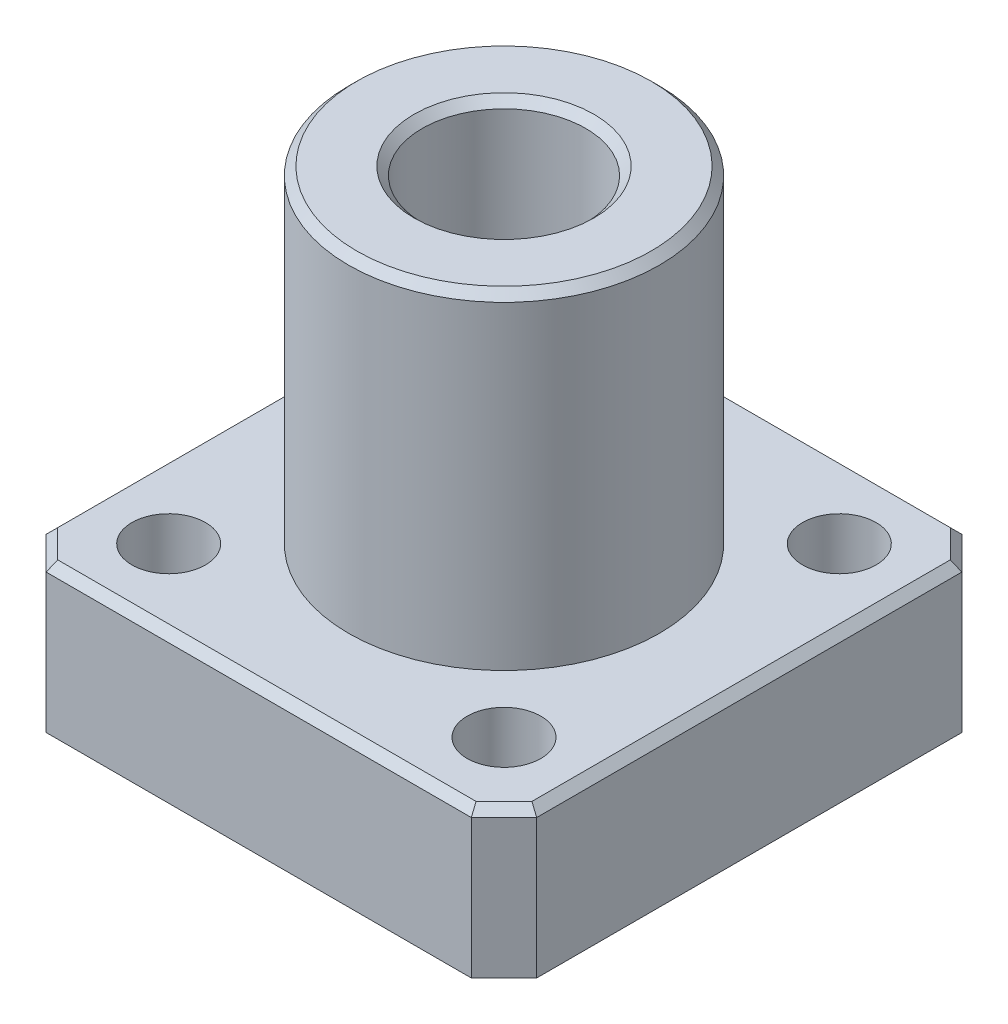
ISO-10303-21;
HEADER;
FILE_DESCRIPTION(('STEP AP214'),'2;1');
FILE_NAME('part.step','',(''),(''),'','','');
FILE_SCHEMA(('AUTOMOTIVE_DESIGN { 1 0 10303 214 1 1 1 1 }'));
ENDSEC;
DATA;
#1=APPLICATION_CONTEXT('core data for automotive mechanical design processes');
#2=APPLICATION_PROTOCOL_DEFINITION('international standard','automotive_design',2000,#1);
#3=PRODUCT_CONTEXT('',#1,'mechanical');
#4=PRODUCT('Part','Part','',(#3));
#5=PRODUCT_RELATED_PRODUCT_CATEGORY('part','',(#4));
#6=PRODUCT_DEFINITION_FORMATION('','',#4);
#7=PRODUCT_DEFINITION_CONTEXT('part definition',#1,'design');
#8=PRODUCT_DEFINITION('design','',#6,#7);
#9=PRODUCT_DEFINITION_SHAPE('','',#8);
#10=(LENGTH_UNIT() NAMED_UNIT(*) SI_UNIT(.MILLI.,.METRE.));
#11=(NAMED_UNIT(*) PLANE_ANGLE_UNIT() SI_UNIT($,.RADIAN.));
#12=(NAMED_UNIT(*) SI_UNIT($,.STERADIAN.) SOLID_ANGLE_UNIT());
#13=UNCERTAINTY_MEASURE_WITH_UNIT(LENGTH_MEASURE(1.E-05),#10,'distance_accuracy_value','');
#14=(GEOMETRIC_REPRESENTATION_CONTEXT(3) GLOBAL_UNCERTAINTY_ASSIGNED_CONTEXT((#13)) GLOBAL_UNIT_ASSIGNED_CONTEXT((#10,
#11,#12)) REPRESENTATION_CONTEXT('',''));
#15=CARTESIAN_POINT('',(0.,0.,0.));
#16=DIRECTION('',(0.,0.,1.));
#17=DIRECTION('',(1.,0.,0.));
#18=AXIS2_PLACEMENT_3D('',#15,#16,#17);
#19=CARTESIAN_POINT('',(0.,9.,-30.));
#20=DIRECTION('',(0.,-1.,0.));
#21=DIRECTION('',(0.,0.,-1.));
#22=AXIS2_PLACEMENT_3D('',#19,#20,#21);
#23=PLANE('',#22);
#24=DIRECTION('',(0.,0.,-1.));
#25=VECTOR('',#24,1.);
#26=CARTESIAN_POINT('',(29.5,9.,-30.));
#27=LINE('',#26,#25);
#28=CARTESIAN_POINT('',(29.5,9.,-2.20710678118656));
#29=VERTEX_POINT('',#28);
#30=CARTESIAN_POINT('',(29.5,9.,-27.7928932188134));
#31=VERTEX_POINT('',#30);
#32=EDGE_CURVE('E207',#29,#31,#27,.T.);
#33=ORIENTED_EDGE('',*,*,#32,.T.);
#34=DIRECTION('',(-0.707106781186546,0.,-0.707106781186549));
#35=VECTOR('',#34,1.);
#36=CARTESIAN_POINT('',(27.6464466094067,9.,-29.6464466094067));
#37=LINE('',#36,#35);
#38=CARTESIAN_POINT('',(27.7928932188134,9.,-29.5));
#39=VERTEX_POINT('',#38);
#40=EDGE_CURVE('E209',#31,#39,#37,.T.);
#41=ORIENTED_EDGE('',*,*,#40,.T.);
#42=DIRECTION('',(-1.,0.,0.));
#43=VECTOR('',#42,1.);
#44=CARTESIAN_POINT('',(0.,9.,-29.5));
#45=LINE('',#44,#43);
#46=CARTESIAN_POINT('',(2.20710678118656,9.,-29.5));
#47=VERTEX_POINT('',#46);
#48=EDGE_CURVE('E199',#39,#47,#45,.T.);
#49=ORIENTED_EDGE('',*,*,#48,.T.);
#50=DIRECTION('',(-0.707106781186549,0.,0.707106781186546));
#51=VECTOR('',#50,1.);
#52=CARTESIAN_POINT('',(0.35355339059327,9.,-27.6464466094067));
#53=LINE('',#52,#51);
#54=CARTESIAN_POINT('',(0.5,9.,-27.7928932188134));
#55=VERTEX_POINT('',#54);
#56=EDGE_CURVE('E197',#47,#55,#53,.T.);
#57=ORIENTED_EDGE('',*,*,#56,.T.);
#58=DIRECTION('',(0.,0.,1.));
#59=VECTOR('',#58,1.);
#60=CARTESIAN_POINT('',(0.5,9.,-30.));
#61=LINE('',#60,#59);
#62=CARTESIAN_POINT('',(0.5,9.,-2.20710678118656));
#63=VERTEX_POINT('',#62);
#64=EDGE_CURVE('E195',#55,#63,#61,.T.);
#65=ORIENTED_EDGE('',*,*,#64,.T.);
#66=DIRECTION('',(0.707106781186546,0.,0.707106781186549));
#67=VECTOR('',#66,1.);
#68=CARTESIAN_POINT('',(2.35355339059328,9.,-0.353553390593274));
#69=LINE('',#68,#67);
#70=CARTESIAN_POINT('',(2.20710678118656,9.,-0.5));
#71=VERTEX_POINT('',#70);
#72=EDGE_CURVE('E201',#63,#71,#69,.T.);
#73=ORIENTED_EDGE('',*,*,#72,.T.);
#74=DIRECTION('',(1.,0.,0.));
#75=VECTOR('',#74,1.);
#76=CARTESIAN_POINT('',(0.,9.,-0.5));
#77=LINE('',#76,#75);
#78=CARTESIAN_POINT('',(27.7928932188134,9.,-0.5));
#79=VERTEX_POINT('',#78);
#80=EDGE_CURVE('E203',#71,#79,#77,.T.);
#81=ORIENTED_EDGE('',*,*,#80,.T.);
#82=DIRECTION('',(0.707106781186549,0.,-0.707106781186546));
#83=VECTOR('',#82,1.);
#84=CARTESIAN_POINT('',(29.6464466094067,9.,-2.35355339059328));
#85=LINE('',#84,#83);
#86=EDGE_CURVE('E205',#79,#29,#85,.T.);
#87=ORIENTED_EDGE('',*,*,#86,.T.);
#88=EDGE_LOOP('',(#33,#41,#49,#57,#65,#73,#81,#87));
#89=FACE_BOUND('',#88,.T.);
#90=CARTESIAN_POINT('',(4.74695167279506,9.,-4.74695167279506));
#91=DIRECTION('',(0.,1.,0.));
#92=DIRECTION('',(0.,0.,-1.));
#93=AXIS2_PLACEMENT_3D('',#90,#91,#92);
#94=CIRCLE('',#93,2.25);
#95=CARTESIAN_POINT('',(4.74695167279506,9.,-6.99695167279506));
#96=VERTEX_POINT('',#95);
#97=EDGE_CURVE('E253',#96,#96,#94,.T.);
#98=ORIENTED_EDGE('',*,*,#97,.F.);
#99=EDGE_LOOP('',(#98));
#100=FACE_BOUND('',#99,.T.);
#101=CARTESIAN_POINT('',(25.2530483272049,9.,-25.2530483272049));
#102=DIRECTION('',(0.,1.,0.));
#103=DIRECTION('',(0.,0.,-1.));
#104=AXIS2_PLACEMENT_3D('',#101,#102,#103);
#105=CIRCLE('',#104,2.25);
#106=CARTESIAN_POINT('',(25.2530483272049,9.,-27.5030483272049));
#107=VERTEX_POINT('',#106);
#108=EDGE_CURVE('E267',#107,#107,#105,.T.);
#109=ORIENTED_EDGE('',*,*,#108,.F.);
#110=EDGE_LOOP('',(#109));
#111=FACE_BOUND('',#110,.T.);
#112=CARTESIAN_POINT('',(4.74695167279506,9.,-25.2530483272049));
#113=DIRECTION('',(0.,1.,0.));
#114=DIRECTION('',(0.,0.,1.));
#115=AXIS2_PLACEMENT_3D('',#112,#113,#114);
#116=CIRCLE('',#115,2.25);
#117=CARTESIAN_POINT('',(4.74695167279506,9.,-23.0030483272049));
#118=VERTEX_POINT('',#117);
#119=EDGE_CURVE('E143',#118,#118,#116,.T.);
#120=ORIENTED_EDGE('',*,*,#119,.F.);
#121=EDGE_LOOP('',(#120));
#122=FACE_BOUND('',#121,.T.);
#123=CARTESIAN_POINT('',(25.2530483272049,9.,-4.74695167279506));
#124=DIRECTION('',(0.,1.,0.));
#125=DIRECTION('',(0.,0.,1.));
#126=AXIS2_PLACEMENT_3D('',#123,#124,#125);
#127=CIRCLE('',#126,2.25);
#128=CARTESIAN_POINT('',(25.2530483272049,9.,-2.49695167279506));
#129=VERTEX_POINT('',#128);
#130=EDGE_CURVE('E261',#129,#129,#127,.T.);
#131=ORIENTED_EDGE('',*,*,#130,.F.);
#132=EDGE_LOOP('',(#131));
#133=FACE_BOUND('',#132,.T.);
#134=CARTESIAN_POINT('',(15.,9.,-15.));
#135=DIRECTION('',(0.,-1.,0.));
#136=DIRECTION('',(0.,0.,-1.));
#137=AXIS2_PLACEMENT_3D('',#134,#135,#136);
#138=CIRCLE('',#137,9.5);
#139=CARTESIAN_POINT('',(15.,9.,-24.5));
#140=VERTEX_POINT('',#139);
#141=EDGE_CURVE('E157',#140,#140,#138,.F.);
#142=ORIENTED_EDGE('',*,*,#141,.F.);
#143=EDGE_LOOP('',(#142));
#144=FACE_BOUND('',#143,.T.);
#145=ADVANCED_FACE('F31',(#89,#100,#111,#122,#133,#144),#23,.F.);
#146=CARTESIAN_POINT('',(0.,0.,-30.));
#147=DIRECTION('',(0.,-1.,0.));
#148=DIRECTION('',(0.,0.,-1.));
#149=AXIS2_PLACEMENT_3D('',#146,#147,#148);
#150=PLANE('',#149);
#151=CARTESIAN_POINT('',(15.,0.,-15.));
#152=DIRECTION('',(0.,-1.,0.));
#153=DIRECTION('',(0.,0.,-1.));
#154=AXIS2_PLACEMENT_3D('',#151,#152,#153);
#155=CIRCLE('',#154,5.49999999999999);
#156=CARTESIAN_POINT('',(15.,0.,-20.5));
#157=VERTEX_POINT('',#156);
#158=EDGE_CURVE('E192',#157,#157,#155,.F.);
#159=ORIENTED_EDGE('',*,*,#158,.T.);
#160=EDGE_LOOP('',(#159));
#161=FACE_BOUND('',#160,.T.);
#162=CARTESIAN_POINT('',(25.2530483272049,0.,-4.74695167279506));
#163=DIRECTION('',(0.,1.,0.));
#164=DIRECTION('',(0.,0.,1.));
#165=AXIS2_PLACEMENT_3D('',#162,#163,#164);
#166=CIRCLE('',#165,2.25);
#167=CARTESIAN_POINT('',(25.2530483272049,0.,-2.49695167279506));
#168=VERTEX_POINT('',#167);
#169=EDGE_CURVE('E258',#168,#168,#166,.T.);
#170=ORIENTED_EDGE('',*,*,#169,.T.);
#171=EDGE_LOOP('',(#170));
#172=FACE_BOUND('',#171,.T.);
#173=CARTESIAN_POINT('',(4.74695167279506,0.,-25.2530483272049));
#174=DIRECTION('',(0.,1.,0.));
#175=DIRECTION('',(0.,0.,1.));
#176=AXIS2_PLACEMENT_3D('',#173,#174,#175);
#177=CIRCLE('',#176,2.25);
#178=CARTESIAN_POINT('',(4.74695167279506,0.,-23.0030483272049));
#179=VERTEX_POINT('',#178);
#180=EDGE_CURVE('E149',#179,#179,#177,.T.);
#181=ORIENTED_EDGE('',*,*,#180,.T.);
#182=EDGE_LOOP('',(#181));
#183=FACE_BOUND('',#182,.T.);
#184=DIRECTION('',(0.,0.,1.));
#185=VECTOR('',#184,1.);
#186=CARTESIAN_POINT('',(0.,0.,0.));
#187=LINE('',#186,#185);
#188=CARTESIAN_POINT('',(0.,0.,-28.));
#189=VERTEX_POINT('',#188);
#190=CARTESIAN_POINT('',(0.,0.,-2.00000000000002));
#191=VERTEX_POINT('',#190);
#192=EDGE_CURVE('E123',#189,#191,#187,.T.);
#193=ORIENTED_EDGE('',*,*,#192,.F.);
#194=DIRECTION('',(-0.707106781186549,0.,0.707106781186546));
#195=VECTOR('',#194,1.);
#196=CARTESIAN_POINT('',(1.,0.,-29.));
#197=LINE('',#196,#195);
#198=CARTESIAN_POINT('',(2.00000000000002,0.,-30.));
#199=VERTEX_POINT('',#198);
#200=EDGE_CURVE('E129',#189,#199,#197,.F.);
#201=ORIENTED_EDGE('',*,*,#200,.T.);
#202=DIRECTION('',(-1.,0.,0.));
#203=VECTOR('',#202,1.);
#204=CARTESIAN_POINT('',(0.,0.,-30.));
#205=LINE('',#204,#203);
#206=CARTESIAN_POINT('',(28.,0.,-30.));
#207=VERTEX_POINT('',#206);
#208=EDGE_CURVE('E155',#207,#199,#205,.T.);
#209=ORIENTED_EDGE('',*,*,#208,.F.);
#210=DIRECTION('',(-0.707106781186546,0.,-0.707106781186549));
#211=VECTOR('',#210,1.);
#212=CARTESIAN_POINT('',(14.,0.,-44.));
#213=LINE('',#212,#211);
#214=CARTESIAN_POINT('',(30.,0.,-28.));
#215=VERTEX_POINT('',#214);
#216=EDGE_CURVE('E136',#207,#215,#213,.F.);
#217=ORIENTED_EDGE('',*,*,#216,.T.);
#218=DIRECTION('',(0.,0.,-1.));
#219=VECTOR('',#218,1.);
#220=CARTESIAN_POINT('',(30.,0.,0.));
#221=LINE('',#220,#219);
#222=CARTESIAN_POINT('',(30.,0.,-2.00000000000003));
#223=VERTEX_POINT('',#222);
#224=EDGE_CURVE('E146',#223,#215,#221,.T.);
#225=ORIENTED_EDGE('',*,*,#224,.F.);
#226=DIRECTION('',(0.707106781186549,0.,-0.707106781186546));
#227=VECTOR('',#226,1.);
#228=CARTESIAN_POINT('',(28.9999999999999,0.,-0.999999999999966));
#229=LINE('',#228,#227);
#230=CARTESIAN_POINT('',(28.,0.,0.));
#231=VERTEX_POINT('',#230);
#232=EDGE_CURVE('E162',#223,#231,#229,.F.);
#233=ORIENTED_EDGE('',*,*,#232,.T.);
#234=DIRECTION('',(1.,0.,0.));
#235=VECTOR('',#234,1.);
#236=CARTESIAN_POINT('',(0.,0.,0.));
#237=LINE('',#236,#235);
#238=CARTESIAN_POINT('',(2.00000000000002,0.,0.));
#239=VERTEX_POINT('',#238);
#240=EDGE_CURVE('E142',#239,#231,#237,.T.);
#241=ORIENTED_EDGE('',*,*,#240,.F.);
#242=DIRECTION('',(0.707106781186546,0.,0.707106781186549));
#243=VECTOR('',#242,1.);
#244=CARTESIAN_POINT('',(-14.,0.,-16.0000000000001));
#245=LINE('',#244,#243);
#246=EDGE_CURVE('E126',#239,#191,#245,.F.);
#247=ORIENTED_EDGE('',*,*,#246,.T.);
#248=EDGE_LOOP('',(#193,#201,#209,#217,#225,#233,#241,#247));
#249=FACE_BOUND('',#248,.T.);
#250=CARTESIAN_POINT('',(25.2530483272049,0.,-25.2530483272049));
#251=DIRECTION('',(0.,1.,0.));
#252=DIRECTION('',(0.,0.,-1.));
#253=AXIS2_PLACEMENT_3D('',#250,#251,#252);
#254=CIRCLE('',#253,2.25);
#255=CARTESIAN_POINT('',(25.2530483272049,0.,-27.5030483272049));
#256=VERTEX_POINT('',#255);
#257=EDGE_CURVE('E264',#256,#256,#254,.T.);
#258=ORIENTED_EDGE('',*,*,#257,.T.);
#259=EDGE_LOOP('',(#258));
#260=FACE_BOUND('',#259,.T.);
#261=CARTESIAN_POINT('',(4.74695167279506,0.,-4.74695167279506));
#262=DIRECTION('',(0.,1.,0.));
#263=DIRECTION('',(0.,0.,-1.));
#264=AXIS2_PLACEMENT_3D('',#261,#262,#263);
#265=CIRCLE('',#264,2.25);
#266=CARTESIAN_POINT('',(4.74695167279506,0.,-6.99695167279506));
#267=VERTEX_POINT('',#266);
#268=EDGE_CURVE('E247',#267,#267,#265,.T.);
#269=ORIENTED_EDGE('',*,*,#268,.T.);
#270=EDGE_LOOP('',(#269));
#271=FACE_BOUND('',#270,.T.);
#272=ADVANCED_FACE('F138',(#161,#172,#183,#249,#260,#271),#150,.T.);
#273=CARTESIAN_POINT('',(0.,9.,0.));
#274=DIRECTION('',(1.,0.,0.));
#275=DIRECTION('',(0.,0.,-1.));
#276=AXIS2_PLACEMENT_3D('',#273,#274,#275);
#277=PLANE('',#276);
#278=DIRECTION('',(0.,1.,0.));
#279=VECTOR('',#278,1.);
#280=CARTESIAN_POINT('',(0.,9.,-2.00000000000002));
#281=LINE('',#280,#279);
#282=CARTESIAN_POINT('',(0.,8.5,-2.00000000000002));
#283=VERTEX_POINT('',#282);
#284=EDGE_CURVE('E127',#191,#283,#281,.T.);
#285=ORIENTED_EDGE('',*,*,#284,.T.);
#286=DIRECTION('',(0.,0.,-1.));
#287=VECTOR('',#286,1.);
#288=CARTESIAN_POINT('',(0.,8.5,0.));
#289=LINE('',#288,#287);
#290=CARTESIAN_POINT('',(0.,8.5,-28.));
#291=VERTEX_POINT('',#290);
#292=EDGE_CURVE('E11',#283,#291,#289,.T.);
#293=ORIENTED_EDGE('',*,*,#292,.T.);
#294=DIRECTION('',(0.,-1.,0.));
#295=VECTOR('',#294,1.);
#296=CARTESIAN_POINT('',(0.,9.,-28.));
#297=LINE('',#296,#295);
#298=EDGE_CURVE('E119',#291,#189,#297,.T.);
#299=ORIENTED_EDGE('',*,*,#298,.T.);
#300=ORIENTED_EDGE('',*,*,#192,.T.);
#301=EDGE_LOOP('',(#285,#293,#299,#300));
#302=FACE_BOUND('',#301,.T.);
#303=ADVANCED_FACE('F121',(#302),#277,.F.);
#304=CARTESIAN_POINT('',(0.,9.,0.));
#305=DIRECTION('',(0.,0.,-1.));
#306=DIRECTION('',(-1.,0.,0.));
#307=AXIS2_PLACEMENT_3D('',#304,#305,#306);
#308=PLANE('',#307);
#309=DIRECTION('',(0.,1.,0.));
#310=VECTOR('',#309,1.);
#311=CARTESIAN_POINT('',(28.,9.,0.));
#312=LINE('',#311,#310);
#313=CARTESIAN_POINT('',(28.,8.5,0.));
#314=VERTEX_POINT('',#313);
#315=EDGE_CURVE('E174',#231,#314,#312,.T.);
#316=ORIENTED_EDGE('',*,*,#315,.T.);
#317=DIRECTION('',(-1.,0.,0.));
#318=VECTOR('',#317,1.);
#319=CARTESIAN_POINT('',(0.,8.5,0.));
#320=LINE('',#319,#318);
#321=CARTESIAN_POINT('',(2.00000000000001,8.5,0.));
#322=VERTEX_POINT('',#321);
#323=EDGE_CURVE('E219',#314,#322,#320,.T.);
#324=ORIENTED_EDGE('',*,*,#323,.T.);
#325=DIRECTION('',(0.,-1.,0.));
#326=VECTOR('',#325,1.);
#327=CARTESIAN_POINT('',(2.00000000000001,9.,0.));
#328=LINE('',#327,#326);
#329=EDGE_CURVE('E172',#322,#239,#328,.T.);
#330=ORIENTED_EDGE('',*,*,#329,.T.);
#331=ORIENTED_EDGE('',*,*,#240,.T.);
#332=EDGE_LOOP('',(#316,#324,#330,#331));
#333=FACE_BOUND('',#332,.T.);
#334=ADVANCED_FACE('F305',(#333),#308,.F.);
#335=CARTESIAN_POINT('',(30.,9.,0.));
#336=DIRECTION('',(-1.,0.,0.));
#337=DIRECTION('',(0.,0.,1.));
#338=AXIS2_PLACEMENT_3D('',#335,#336,#337);
#339=PLANE('',#338);
#340=DIRECTION('',(0.,1.,0.));
#341=VECTOR('',#340,1.);
#342=CARTESIAN_POINT('',(30.,9.,-28.));
#343=LINE('',#342,#341);
#344=CARTESIAN_POINT('',(30.,8.5,-28.));
#345=VERTEX_POINT('',#344);
#346=EDGE_CURVE('E169',#215,#345,#343,.T.);
#347=ORIENTED_EDGE('',*,*,#346,.T.);
#348=DIRECTION('',(0.,0.,1.));
#349=VECTOR('',#348,1.);
#350=CARTESIAN_POINT('',(30.,8.5,0.));
#351=LINE('',#350,#349);
#352=CARTESIAN_POINT('',(30.,8.5,-2.00000000000001));
#353=VERTEX_POINT('',#352);
#354=EDGE_CURVE('E215',#345,#353,#351,.T.);
#355=ORIENTED_EDGE('',*,*,#354,.T.);
#356=DIRECTION('',(0.,-1.,0.));
#357=VECTOR('',#356,1.);
#358=CARTESIAN_POINT('',(30.,9.,-2.00000000000001));
#359=LINE('',#358,#357);
#360=EDGE_CURVE('E167',#353,#223,#359,.T.);
#361=ORIENTED_EDGE('',*,*,#360,.T.);
#362=ORIENTED_EDGE('',*,*,#224,.T.);
#363=EDGE_LOOP('',(#347,#355,#361,#362));
#364=FACE_BOUND('',#363,.T.);
#365=ADVANCED_FACE('F301',(#364),#339,.F.);
#366=CARTESIAN_POINT('',(0.,9.,-30.));
#367=DIRECTION('',(0.,0.,1.));
#368=DIRECTION('',(1.,0.,0.));
#369=AXIS2_PLACEMENT_3D('',#366,#367,#368);
#370=PLANE('',#369);
#371=DIRECTION('',(0.,1.,0.));
#372=VECTOR('',#371,1.);
#373=CARTESIAN_POINT('',(2.00000000000002,9.,-30.));
#374=LINE('',#373,#372);
#375=CARTESIAN_POINT('',(2.00000000000002,8.5,-30.));
#376=VERTEX_POINT('',#375);
#377=EDGE_CURVE('E131',#199,#376,#374,.T.);
#378=ORIENTED_EDGE('',*,*,#377,.T.);
#379=DIRECTION('',(1.,0.,0.));
#380=VECTOR('',#379,1.);
#381=CARTESIAN_POINT('',(0.,8.5,-30.));
#382=LINE('',#381,#380);
#383=CARTESIAN_POINT('',(28.,8.5,-30.));
#384=VERTEX_POINT('',#383);
#385=EDGE_CURVE('E223',#376,#384,#382,.T.);
#386=ORIENTED_EDGE('',*,*,#385,.T.);
#387=DIRECTION('',(0.,-1.,0.));
#388=VECTOR('',#387,1.);
#389=CARTESIAN_POINT('',(28.,9.,-30.));
#390=LINE('',#389,#388);
#391=EDGE_CURVE('E135',#384,#207,#390,.T.);
#392=ORIENTED_EDGE('',*,*,#391,.T.);
#393=ORIENTED_EDGE('',*,*,#208,.T.);
#394=EDGE_LOOP('',(#378,#386,#392,#393));
#395=FACE_BOUND('',#394,.T.);
#396=ADVANCED_FACE('F286',(#395),#370,.F.);
#397=CARTESIAN_POINT('',(4.74695167279506,9.,-25.2530483272049));
#398=DIRECTION('',(0.,-1.,0.));
#399=DIRECTION('',(0.,0.,-1.));
#400=AXIS2_PLACEMENT_3D('',#397,#398,#399);
#401=CYLINDRICAL_SURFACE('',#400,2.25);
#402=ORIENTED_EDGE('',*,*,#119,.T.);
#403=EDGE_LOOP('',(#402));
#404=FACE_BOUND('',#403,.T.);
#405=ORIENTED_EDGE('',*,*,#180,.F.);
#406=EDGE_LOOP('',(#405));
#407=FACE_BOUND('',#406,.T.);
#408=ADVANCED_FACE('F276',(#404,#407),#401,.F.);
#409=CARTESIAN_POINT('',(25.2530483272049,9.,-25.2530483272049));
#410=DIRECTION('',(0.,-1.,0.));
#411=DIRECTION('',(0.,0.,-1.));
#412=AXIS2_PLACEMENT_3D('',#409,#410,#411);
#413=CYLINDRICAL_SURFACE('',#412,2.25);
#414=ORIENTED_EDGE('',*,*,#108,.T.);
#415=EDGE_LOOP('',(#414));
#416=FACE_BOUND('',#415,.T.);
#417=ORIENTED_EDGE('',*,*,#257,.F.);
#418=EDGE_LOOP('',(#417));
#419=FACE_BOUND('',#418,.T.);
#420=ADVANCED_FACE('F273',(#416,#419),#413,.F.);
#421=CARTESIAN_POINT('',(25.2530483272049,9.,-4.74695167279506));
#422=DIRECTION('',(0.,-1.,0.));
#423=DIRECTION('',(0.,0.,-1.));
#424=AXIS2_PLACEMENT_3D('',#421,#422,#423);
#425=CYLINDRICAL_SURFACE('',#424,2.25);
#426=ORIENTED_EDGE('',*,*,#130,.T.);
#427=EDGE_LOOP('',(#426));
#428=FACE_BOUND('',#427,.T.);
#429=ORIENTED_EDGE('',*,*,#169,.F.);
#430=EDGE_LOOP('',(#429));
#431=FACE_BOUND('',#430,.T.);
#432=ADVANCED_FACE('F275',(#428,#431),#425,.F.);
#433=CARTESIAN_POINT('',(4.74695167279506,9.,-4.74695167279506));
#434=DIRECTION('',(0.,-1.,0.));
#435=DIRECTION('',(0.,0.,-1.));
#436=AXIS2_PLACEMENT_3D('',#433,#434,#435);
#437=CYLINDRICAL_SURFACE('',#436,2.25);
#438=ORIENTED_EDGE('',*,*,#97,.T.);
#439=EDGE_LOOP('',(#438));
#440=FACE_BOUND('',#439,.T.);
#441=ORIENTED_EDGE('',*,*,#268,.F.);
#442=EDGE_LOOP('',(#441));
#443=FACE_BOUND('',#442,.T.);
#444=ADVANCED_FACE('F283',(#440,#443),#437,.F.);
#445=CARTESIAN_POINT('',(15.,29.,-15.));
#446=DIRECTION('',(0.,-1.,0.));
#447=DIRECTION('',(0.,0.,-1.));
#448=AXIS2_PLACEMENT_3D('',#445,#446,#447);
#449=CYLINDRICAL_SURFACE('',#448,9.5);
#450=CARTESIAN_POINT('',(15.,28.5,-15.));
#451=DIRECTION('',(0.,1.,0.));
#452=DIRECTION('',(0.,0.,1.));
#453=AXIS2_PLACEMENT_3D('',#450,#451,#452);
#454=CIRCLE('',#453,9.5);
#455=CARTESIAN_POINT('',(15.,28.5,-5.5));
#456=VERTEX_POINT('',#455);
#457=EDGE_CURVE('E183',#456,#456,#454,.F.);
#458=ORIENTED_EDGE('',*,*,#457,.T.);
#459=EDGE_LOOP('',(#458));
#460=FACE_BOUND('',#459,.T.);
#461=ORIENTED_EDGE('',*,*,#141,.T.);
#462=EDGE_LOOP('',(#461));
#463=FACE_BOUND('',#462,.T.);
#464=ADVANCED_FACE('F435',(#460,#463),#449,.T.);
#465=CARTESIAN_POINT('',(15.,29.,-15.));
#466=DIRECTION('',(0.,1.,0.));
#467=DIRECTION('',(0.,0.,1.));
#468=AXIS2_PLACEMENT_3D('',#465,#466,#467);
#469=PLANE('',#468);
#470=CARTESIAN_POINT('',(15.,29.,-15.));
#471=DIRECTION('',(0.,1.,0.));
#472=DIRECTION('',(0.,0.,1.));
#473=AXIS2_PLACEMENT_3D('',#470,#471,#472);
#474=CIRCLE('',#473,9.);
#475=CARTESIAN_POINT('',(15.,29.,-6.));
#476=VERTEX_POINT('',#475);
#477=EDGE_CURVE('E180',#476,#476,#474,.T.);
#478=ORIENTED_EDGE('',*,*,#477,.T.);
#479=EDGE_LOOP('',(#478));
#480=FACE_BOUND('',#479,.T.);
#481=CARTESIAN_POINT('',(15.,29.,-15.));
#482=DIRECTION('',(0.,1.,0.));
#483=DIRECTION('',(0.,0.,1.));
#484=AXIS2_PLACEMENT_3D('',#481,#482,#483);
#485=CIRCLE('',#484,5.5);
#486=CARTESIAN_POINT('',(15.,29.,-9.5));
#487=VERTEX_POINT('',#486);
#488=EDGE_CURVE('E177',#487,#487,#485,.F.);
#489=ORIENTED_EDGE('',*,*,#488,.T.);
#490=EDGE_LOOP('',(#489));
#491=FACE_BOUND('',#490,.T.);
#492=ADVANCED_FACE('F315',(#480,#491),#469,.T.);
#493=CARTESIAN_POINT('',(0.,9.,-28.));
#494=DIRECTION('',(0.707106781186546,0.,0.707106781186549));
#495=DIRECTION('',(0.707106781186549,0.,-0.707106781186546));
#496=AXIS2_PLACEMENT_3D('',#493,#494,#495);
#497=PLANE('',#496);
#498=ORIENTED_EDGE('',*,*,#298,.F.);
#499=DIRECTION('',(-0.707106781186549,0.,0.707106781186546));
#500=VECTOR('',#499,1.);
#501=CARTESIAN_POINT('',(2.00000000000002,8.5,-30.));
#502=LINE('',#501,#500);
#503=EDGE_CURVE('E40',#291,#376,#502,.F.);
#504=ORIENTED_EDGE('',*,*,#503,.T.);
#505=ORIENTED_EDGE('',*,*,#377,.F.);
#506=ORIENTED_EDGE('',*,*,#200,.F.);
#507=EDGE_LOOP('',(#498,#504,#505,#506));
#508=FACE_BOUND('',#507,.T.);
#509=ADVANCED_FACE('F130',(#508),#497,.F.);
#510=CARTESIAN_POINT('',(28.,9.,-30.));
#511=DIRECTION('',(-0.707106781186549,0.,0.707106781186546));
#512=DIRECTION('',(0.707106781186546,0.,0.707106781186549));
#513=AXIS2_PLACEMENT_3D('',#510,#511,#512);
#514=PLANE('',#513);
#515=ORIENTED_EDGE('',*,*,#391,.F.);
#516=DIRECTION('',(-0.707106781186546,0.,-0.707106781186549));
#517=VECTOR('',#516,1.);
#518=CARTESIAN_POINT('',(30.,8.5,-28.));
#519=LINE('',#518,#517);
#520=EDGE_CURVE('E212',#384,#345,#519,.F.);
#521=ORIENTED_EDGE('',*,*,#520,.T.);
#522=ORIENTED_EDGE('',*,*,#346,.F.);
#523=ORIENTED_EDGE('',*,*,#216,.F.);
#524=EDGE_LOOP('',(#515,#521,#522,#523));
#525=FACE_BOUND('',#524,.T.);
#526=ADVANCED_FACE('F314',(#525),#514,.F.);
#527=CARTESIAN_POINT('',(30.,9.,-2.00000000000001));
#528=DIRECTION('',(-0.707106781186546,0.,-0.707106781186549));
#529=DIRECTION('',(-0.707106781186549,0.,0.707106781186546));
#530=AXIS2_PLACEMENT_3D('',#527,#528,#529);
#531=PLANE('',#530);
#532=ORIENTED_EDGE('',*,*,#360,.F.);
#533=DIRECTION('',(0.707106781186549,0.,-0.707106781186546));
#534=VECTOR('',#533,1.);
#535=CARTESIAN_POINT('',(28.,8.5,0.));
#536=LINE('',#535,#534);
#537=EDGE_CURVE('E217',#353,#314,#536,.F.);
#538=ORIENTED_EDGE('',*,*,#537,.T.);
#539=ORIENTED_EDGE('',*,*,#315,.F.);
#540=ORIENTED_EDGE('',*,*,#232,.F.);
#541=EDGE_LOOP('',(#532,#538,#539,#540));
#542=FACE_BOUND('',#541,.T.);
#543=ADVANCED_FACE('F318',(#542),#531,.F.);
#544=CARTESIAN_POINT('',(2.00000000000001,9.,0.));
#545=DIRECTION('',(0.707106781186549,0.,-0.707106781186546));
#546=DIRECTION('',(-0.707106781186546,0.,-0.707106781186549));
#547=AXIS2_PLACEMENT_3D('',#544,#545,#546);
#548=PLANE('',#547);
#549=ORIENTED_EDGE('',*,*,#329,.F.);
#550=DIRECTION('',(0.707106781186546,0.,0.707106781186549));
#551=VECTOR('',#550,1.);
#552=CARTESIAN_POINT('',(0.,8.5,-2.00000000000002));
#553=LINE('',#552,#551);
#554=EDGE_CURVE('E221',#322,#283,#553,.F.);
#555=ORIENTED_EDGE('',*,*,#554,.T.);
#556=ORIENTED_EDGE('',*,*,#284,.F.);
#557=ORIENTED_EDGE('',*,*,#246,.F.);
#558=EDGE_LOOP('',(#549,#555,#556,#557));
#559=FACE_BOUND('',#558,.T.);
#560=ADVANCED_FACE('F322',(#559),#548,.F.);
#561=CARTESIAN_POINT('',(15.,-0.001000000000001,-15.));
#562=DIRECTION('',(0.,1.,0.));
#563=DIRECTION('',(0.,0.,1.));
#564=AXIS2_PLACEMENT_3D('',#561,#562,#563);
#565=CYLINDRICAL_SURFACE('',#564,5.);
#566=CARTESIAN_POINT('',(15.,28.5,-15.));
#567=DIRECTION('',(0.,1.,0.));
#568=DIRECTION('',(0.,0.,1.));
#569=AXIS2_PLACEMENT_3D('',#566,#567,#568);
#570=CIRCLE('',#569,5.);
#571=CARTESIAN_POINT('',(15.,28.5,-10.));
#572=VERTEX_POINT('',#571);
#573=EDGE_CURVE('E189',#572,#572,#570,.T.);
#574=ORIENTED_EDGE('',*,*,#573,.T.);
#575=EDGE_LOOP('',(#574));
#576=FACE_BOUND('',#575,.T.);
#577=CARTESIAN_POINT('',(15.,0.499999999999991,-15.));
#578=DIRECTION('',(0.,-1.,0.));
#579=DIRECTION('',(0.,0.,-1.));
#580=AXIS2_PLACEMENT_3D('',#577,#578,#579);
#581=CIRCLE('',#580,5.);
#582=CARTESIAN_POINT('',(15.,0.499999999999991,-20.));
#583=VERTEX_POINT('',#582);
#584=EDGE_CURVE('E186',#583,#583,#581,.T.);
#585=ORIENTED_EDGE('',*,*,#584,.T.);
#586=EDGE_LOOP('',(#585));
#587=FACE_BOUND('',#586,.T.);
#588=ADVANCED_FACE('F326',(#576,#587),#565,.F.);
#589=CARTESIAN_POINT('',(15.,29.,-15.));
#590=DIRECTION('',(0.,-1.,0.));
#591=DIRECTION('',(0.,0.,-1.));
#592=AXIS2_PLACEMENT_3D('',#589,#590,#591);
#593=CONICAL_SURFACE('',#592,9.,0.785398163397448);
#594=ORIENTED_EDGE('',*,*,#457,.F.);
#595=EDGE_LOOP('',(#594));
#596=FACE_BOUND('',#595,.T.);
#597=ORIENTED_EDGE('',*,*,#477,.F.);
#598=EDGE_LOOP('',(#597));
#599=FACE_BOUND('',#598,.T.);
#600=ADVANCED_FACE('F328',(#596,#599),#593,.T.);
#601=CARTESIAN_POINT('',(15.,28.5,-15.));
#602=DIRECTION('',(0.,1.,0.));
#603=DIRECTION('',(0.,0.,1.));
#604=AXIS2_PLACEMENT_3D('',#601,#602,#603);
#605=CONICAL_SURFACE('',#604,5.,0.785398163397459);
#606=ORIENTED_EDGE('',*,*,#488,.F.);
#607=EDGE_LOOP('',(#606));
#608=FACE_BOUND('',#607,.T.);
#609=ORIENTED_EDGE('',*,*,#573,.F.);
#610=EDGE_LOOP('',(#609));
#611=FACE_BOUND('',#610,.T.);
#612=ADVANCED_FACE('F331',(#608,#611),#605,.F.);
#613=CARTESIAN_POINT('',(15.,0.,-15.));
#614=DIRECTION('',(0.,-1.,0.));
#615=DIRECTION('',(0.,0.,-1.));
#616=AXIS2_PLACEMENT_3D('',#613,#614,#615);
#617=CONICAL_SURFACE('',#616,5.49999999999999,0.785398163397451);
#618=ORIENTED_EDGE('',*,*,#584,.F.);
#619=EDGE_LOOP('',(#618));
#620=FACE_BOUND('',#619,.T.);
#621=ORIENTED_EDGE('',*,*,#158,.F.);
#622=EDGE_LOOP('',(#621));
#623=FACE_BOUND('',#622,.T.);
#624=ADVANCED_FACE('F335',(#620,#623),#617,.F.);
#625=CARTESIAN_POINT('',(-13.6464466094067,9.,-16.3535533905933));
#626=DIRECTION('',(0.500000000000002,-0.707106781186546,-0.5));
#627=DIRECTION('',(0.816496580927725,0.577350269189628,0.));
#628=AXIS2_PLACEMENT_3D('',#625,#626,#627);
#629=PLANE('',#628);
#630=DIRECTION('',(0.678598344545848,0.678598344545848,-0.281084637714816));
#631=VECTOR('',#630,1.);
#632=CARTESIAN_POINT('',(5.80131566847559,14.3013156684756,-4.40298362949011));
#633=LINE('',#632,#631);
#634=EDGE_CURVE('E241',#283,#63,#633,.T.);
#635=ORIENTED_EDGE('',*,*,#634,.F.);
#636=ORIENTED_EDGE('',*,*,#554,.F.);
#637=DIRECTION('',(0.281084637714818,0.678598344545847,-0.678598344545847));
#638=VECTOR('',#637,1.);
#639=CARTESIAN_POINT('',(3.97850351017095,13.2765300074575,-4.77653000745751));
#640=LINE('',#639,#638);
#641=EDGE_CURVE('E35',#71,#322,#640,.F.);
#642=ORIENTED_EDGE('',*,*,#641,.F.);
#643=ORIENTED_EDGE('',*,*,#72,.F.);
#644=EDGE_LOOP('',(#635,#636,#642,#643));
#645=FACE_BOUND('',#644,.T.);
#646=ADVANCED_FACE('F33',(#645),#629,.F.);
#647=CARTESIAN_POINT('',(0.,9.,-0.5));
#648=DIRECTION('',(0.,-0.707106781186547,-0.707106781186547));
#649=DIRECTION('',(0.,0.707106781186548,-0.707106781186548));
#650=AXIS2_PLACEMENT_3D('',#647,#648,#649);
#651=PLANE('',#650);
#652=ORIENTED_EDGE('',*,*,#641,.T.);
#653=ORIENTED_EDGE('',*,*,#323,.F.);
#654=DIRECTION('',(-0.28108463771482,0.678598344545847,-0.678598344545847));
#655=VECTOR('',#654,1.);
#656=CARTESIAN_POINT('',(25.5970163705098,14.3013156684756,-5.80131566847565));
#657=LINE('',#656,#655);
#658=EDGE_CURVE('E239',#79,#314,#657,.F.);
#659=ORIENTED_EDGE('',*,*,#658,.F.);
#660=ORIENTED_EDGE('',*,*,#80,.F.);
#661=EDGE_LOOP('',(#652,#653,#659,#660));
#662=FACE_BOUND('',#661,.T.);
#663=ADVANCED_FACE('F362',(#662),#651,.F.);
#664=CARTESIAN_POINT('',(0.5,9.,-30.));
#665=DIRECTION('',(0.707106781186547,-0.707106781186547,0.));
#666=DIRECTION('',(0.707106781186548,0.707106781186548,0.));
#667=AXIS2_PLACEMENT_3D('',#664,#665,#666);
#668=PLANE('',#667);
#669=ORIENTED_EDGE('',*,*,#634,.T.);
#670=ORIENTED_EDGE('',*,*,#64,.F.);
#671=DIRECTION('',(-0.678598344545846,-0.678598344545846,-0.281084637714823));
#672=VECTOR('',#671,1.);
#673=CARTESIAN_POINT('',(0.0790085735592658,8.57900857355927,-27.967273577288));
#674=LINE('',#673,#672);
#675=EDGE_CURVE('E236',#291,#55,#674,.F.);
#676=ORIENTED_EDGE('',*,*,#675,.F.);
#677=ORIENTED_EDGE('',*,*,#292,.F.);
#678=EDGE_LOOP('',(#669,#670,#676,#677));
#679=FACE_BOUND('',#678,.T.);
#680=ADVANCED_FACE('F359',(#679),#668,.F.);
#681=CARTESIAN_POINT('',(28.6464466094067,9.,-1.35355339059323));
#682=DIRECTION('',(-0.499999999999999,-0.707106781186548,-0.500000000000001));
#683=DIRECTION('',(0.,0.577350269189626,-0.816496580927726));
#684=AXIS2_PLACEMENT_3D('',#681,#682,#683);
#685=PLANE('',#684);
#686=ORIENTED_EDGE('',*,*,#658,.T.);
#687=ORIENTED_EDGE('',*,*,#537,.F.);
#688=DIRECTION('',(-0.678598344545847,0.678598344545847,-0.281084637714821));
#689=VECTOR('',#688,1.);
#690=CARTESIAN_POINT('',(29.2697521433898,9.2302478566102,-2.30247856610184));
#691=LINE('',#690,#689);
#692=EDGE_CURVE('E233',#29,#353,#691,.F.);
#693=ORIENTED_EDGE('',*,*,#692,.F.);
#694=ORIENTED_EDGE('',*,*,#86,.F.);
#695=EDGE_LOOP('',(#686,#687,#693,#694));
#696=FACE_BOUND('',#695,.T.);
#697=ADVANCED_FACE('F355',(#696),#685,.F.);
#698=CARTESIAN_POINT('',(1.35355339059328,9.,-28.6464466094067));
#699=DIRECTION('',(0.499999999999998,-0.707106781186548,0.5));
#700=DIRECTION('',(0.,-0.577350269189625,-0.816496580927726));
#701=AXIS2_PLACEMENT_3D('',#698,#699,#700);
#702=PLANE('',#701);
#703=ORIENTED_EDGE('',*,*,#675,.T.);
#704=ORIENTED_EDGE('',*,*,#56,.F.);
#705=DIRECTION('',(-0.281084637714822,-0.678598344545847,-0.678598344545847));
#706=VECTOR('',#705,1.);
#707=CARTESIAN_POINT('',(2.30247856610184,9.23024785661018,-29.2697521433898));
#708=LINE('',#707,#706);
#709=EDGE_CURVE('E230',#376,#47,#708,.F.);
#710=ORIENTED_EDGE('',*,*,#709,.F.);
#711=ORIENTED_EDGE('',*,*,#503,.F.);
#712=EDGE_LOOP('',(#703,#704,#710,#711));
#713=FACE_BOUND('',#712,.T.);
#714=ADVANCED_FACE('F351',(#713),#702,.F.);
#715=CARTESIAN_POINT('',(29.5,9.,-30.));
#716=DIRECTION('',(-0.707106781186547,-0.707106781186547,0.));
#717=DIRECTION('',(0.707106781186548,-0.707106781186548,0.));
#718=AXIS2_PLACEMENT_3D('',#715,#716,#717);
#719=PLANE('',#718);
#720=ORIENTED_EDGE('',*,*,#692,.T.);
#721=ORIENTED_EDGE('',*,*,#354,.F.);
#722=DIRECTION('',(-0.678598344545846,0.678598344545846,0.281084637714826));
#723=VECTOR('',#722,1.);
#724=CARTESIAN_POINT('',(29.9209914264407,8.57900857355926,-27.967273577288));
#725=LINE('',#724,#723);
#726=EDGE_CURVE('E228',#31,#345,#725,.F.);
#727=ORIENTED_EDGE('',*,*,#726,.F.);
#728=ORIENTED_EDGE('',*,*,#32,.F.);
#729=EDGE_LOOP('',(#720,#721,#727,#728));
#730=FACE_BOUND('',#729,.T.);
#731=ADVANCED_FACE('F347',(#730),#719,.F.);
#732=CARTESIAN_POINT('',(0.,9.,-29.5));
#733=DIRECTION('',(0.,-0.707106781186547,0.707106781186547));
#734=DIRECTION('',(0.,-0.707106781186548,-0.707106781186548));
#735=AXIS2_PLACEMENT_3D('',#732,#733,#734);
#736=PLANE('',#735);
#737=ORIENTED_EDGE('',*,*,#709,.T.);
#738=ORIENTED_EDGE('',*,*,#48,.F.);
#739=DIRECTION('',(0.281084637714827,-0.678598344545846,-0.678598344545846));
#740=VECTOR('',#739,1.);
#741=CARTESIAN_POINT('',(25.5970163705097,14.3013156684758,-24.1986843315242));
#742=LINE('',#741,#740);
#743=EDGE_CURVE('E226',#384,#39,#742,.F.);
#744=ORIENTED_EDGE('',*,*,#743,.F.);
#745=ORIENTED_EDGE('',*,*,#385,.F.);
#746=EDGE_LOOP('',(#737,#738,#744,#745));
#747=FACE_BOUND('',#746,.T.);
#748=ADVANCED_FACE('F343',(#747),#736,.F.);
#749=CARTESIAN_POINT('',(13.6464466094068,9.,-43.6464466094067));
#750=DIRECTION('',(-0.499999999999999,-0.70710678118655,0.499999999999997));
#751=DIRECTION('',(0.816496580927727,-0.577350269189624,0.));
#752=AXIS2_PLACEMENT_3D('',#749,#750,#751);
#753=PLANE('',#752);
#754=ORIENTED_EDGE('',*,*,#726,.T.);
#755=ORIENTED_EDGE('',*,*,#520,.F.);
#756=ORIENTED_EDGE('',*,*,#743,.T.);
#757=ORIENTED_EDGE('',*,*,#40,.F.);
#758=EDGE_LOOP('',(#754,#755,#756,#757));
#759=FACE_BOUND('',#758,.T.);
#760=ADVANCED_FACE('F340',(#759),#753,.F.);
#761=CLOSED_SHELL('',(#145,#272,#303,#334,#365,#396,#408,#420,#432,#444,#464,#492,#509,#526,
#543,#560,#588,#600,#612,#624,#646,#663,#680,#697,#714,#731,#748,#760));
#762=MANIFOLD_SOLID_BREP('B2',#761);
#763=ADVANCED_BREP_SHAPE_REPRESENTATION('',(#18,#762),#14);
#764=SHAPE_DEFINITION_REPRESENTATION(#9,#763);
ENDSEC;
END-ISO-10303-21;
